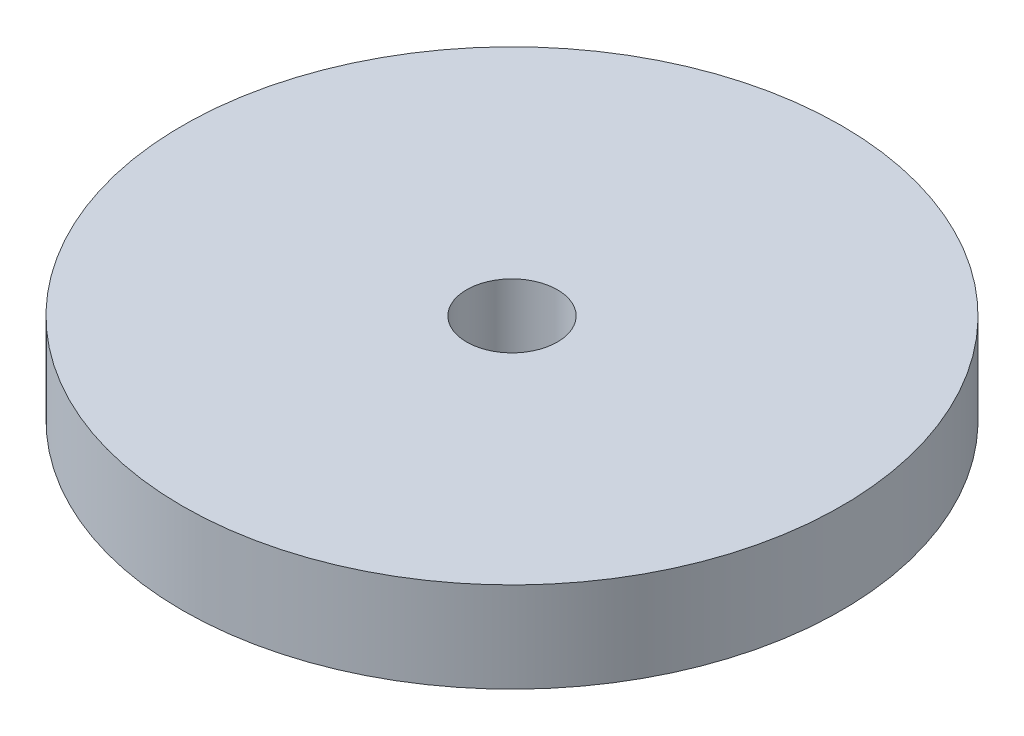
ISO-10303-21;
HEADER;
FILE_DESCRIPTION(('STEP AP214'),'2;1');
FILE_NAME('part.step','',(''),(''),'','','');
FILE_SCHEMA(('AUTOMOTIVE_DESIGN { 1 0 10303 214 1 1 1 1 }'));
ENDSEC;
DATA;
#1=APPLICATION_CONTEXT('core data for automotive mechanical design processes');
#2=APPLICATION_PROTOCOL_DEFINITION('international standard','automotive_design',2000,#1);
#3=PRODUCT_CONTEXT('',#1,'mechanical');
#4=PRODUCT('Part','Part','',(#3));
#5=PRODUCT_RELATED_PRODUCT_CATEGORY('part','',(#4));
#6=PRODUCT_DEFINITION_FORMATION('','',#4);
#7=PRODUCT_DEFINITION_CONTEXT('part definition',#1,'design');
#8=PRODUCT_DEFINITION('design','',#6,#7);
#9=PRODUCT_DEFINITION_SHAPE('','',#8);
#10=(LENGTH_UNIT() NAMED_UNIT(*) SI_UNIT(.MILLI.,.METRE.));
#11=(NAMED_UNIT(*) PLANE_ANGLE_UNIT() SI_UNIT($,.RADIAN.));
#12=(NAMED_UNIT(*) SI_UNIT($,.STERADIAN.) SOLID_ANGLE_UNIT());
#13=UNCERTAINTY_MEASURE_WITH_UNIT(LENGTH_MEASURE(1.E-05),#10,'distance_accuracy_value','');
#14=(GEOMETRIC_REPRESENTATION_CONTEXT(3) GLOBAL_UNCERTAINTY_ASSIGNED_CONTEXT((#13)) GLOBAL_UNIT_ASSIGNED_CONTEXT((#10,
#11,#12)) REPRESENTATION_CONTEXT('',''));
#15=CARTESIAN_POINT('',(0.,0.,0.));
#16=DIRECTION('',(0.,0.,1.));
#17=DIRECTION('',(1.,0.,0.));
#18=AXIS2_PLACEMENT_3D('',#15,#16,#17);
#19=CARTESIAN_POINT('',(0.,5.08,0.));
#20=DIRECTION('',(0.,-1.,0.));
#21=DIRECTION('',(0.,0.,-1.));
#22=AXIS2_PLACEMENT_3D('',#19,#20,#21);
#23=CYLINDRICAL_SURFACE('',#22,18.542);
#24=CARTESIAN_POINT('',(0.,5.08,0.));
#25=DIRECTION('',(0.,1.,0.));
#26=DIRECTION('',(0.,0.,1.));
#27=AXIS2_PLACEMENT_3D('',#24,#25,#26);
#28=CIRCLE('',#27,18.542);
#29=CARTESIAN_POINT('',(0.,5.08,18.542));
#30=VERTEX_POINT('',#29);
#31=EDGE_CURVE('E10',#30,#30,#28,.T.);
#32=ORIENTED_EDGE('',*,*,#31,.F.);
#33=EDGE_LOOP('',(#32));
#34=FACE_BOUND('',#33,.T.);
#35=CARTESIAN_POINT('',(0.,0.,0.));
#36=DIRECTION('',(0.,1.,0.));
#37=DIRECTION('',(0.,0.,1.));
#38=AXIS2_PLACEMENT_3D('',#35,#36,#37);
#39=CIRCLE('',#38,18.542);
#40=CARTESIAN_POINT('',(0.,0.,18.542));
#41=VERTEX_POINT('',#40);
#42=EDGE_CURVE('E36',#41,#41,#39,.T.);
#43=ORIENTED_EDGE('',*,*,#42,.T.);
#44=EDGE_LOOP('',(#43));
#45=FACE_BOUND('',#44,.T.);
#46=ADVANCED_FACE('F33',(#34,#45),#23,.T.);
#47=CARTESIAN_POINT('',(0.,5.08,0.));
#48=DIRECTION('',(0.,1.,0.));
#49=DIRECTION('',(0.,0.,1.));
#50=AXIS2_PLACEMENT_3D('',#47,#48,#49);
#51=PLANE('',#50);
#52=CARTESIAN_POINT('',(0.,5.08,0.));
#53=DIRECTION('',(0.,1.,0.));
#54=DIRECTION('',(0.,0.,1.));
#55=AXIS2_PLACEMENT_3D('',#52,#53,#54);
#56=CIRCLE('',#55,2.55269999999999);
#57=CARTESIAN_POINT('',(0.,5.08,2.55269999999999));
#58=VERTEX_POINT('',#57);
#59=EDGE_CURVE('E47',#58,#58,#56,.T.);
#60=ORIENTED_EDGE('',*,*,#59,.F.);
#61=EDGE_LOOP('',(#60));
#62=FACE_BOUND('',#61,.T.);
#63=ORIENTED_EDGE('',*,*,#31,.T.);
#64=EDGE_LOOP('',(#63));
#65=FACE_BOUND('',#64,.T.);
#66=ADVANCED_FACE('F53',(#62,#65),#51,.T.);
#67=CARTESIAN_POINT('',(0.,0.,0.));
#68=DIRECTION('',(0.,1.,0.));
#69=DIRECTION('',(0.,0.,1.));
#70=AXIS2_PLACEMENT_3D('',#67,#68,#69);
#71=PLANE('',#70);
#72=CARTESIAN_POINT('',(0.,0.,0.));
#73=DIRECTION('',(0.,1.,0.));
#74=DIRECTION('',(0.,0.,1.));
#75=AXIS2_PLACEMENT_3D('',#72,#73,#74);
#76=CIRCLE('',#75,2.5527);
#77=CARTESIAN_POINT('',(0.,0.,2.5527));
#78=VERTEX_POINT('',#77);
#79=EDGE_CURVE('E43',#78,#78,#76,.T.);
#80=ORIENTED_EDGE('',*,*,#79,.T.);
#81=EDGE_LOOP('',(#80));
#82=FACE_BOUND('',#81,.T.);
#83=ORIENTED_EDGE('',*,*,#42,.F.);
#84=EDGE_LOOP('',(#83));
#85=FACE_BOUND('',#84,.T.);
#86=ADVANCED_FACE('F55',(#82,#85),#71,.F.);
#87=CARTESIAN_POINT('',(0.,5.08,0.));
#88=DIRECTION('',(0.,1.,0.));
#89=DIRECTION('',(0.,0.,1.));
#90=AXIS2_PLACEMENT_3D('',#87,#88,#89);
#91=CYLINDRICAL_SURFACE('',#90,2.55269999999999);
#92=ORIENTED_EDGE('',*,*,#79,.F.);
#93=EDGE_LOOP('',(#92));
#94=FACE_BOUND('',#93,.T.);
#95=ORIENTED_EDGE('',*,*,#59,.T.);
#96=EDGE_LOOP('',(#95));
#97=FACE_BOUND('',#96,.T.);
#98=ADVANCED_FACE('F51',(#94,#97),#91,.F.);
#99=CLOSED_SHELL('',(#46,#66,#86,#98));
#100=MANIFOLD_SOLID_BREP('B2',#99);
#101=ADVANCED_BREP_SHAPE_REPRESENTATION('',(#18,#100),#14);
#102=SHAPE_DEFINITION_REPRESENTATION(#9,#101);
ENDSEC;
END-ISO-10303-21;
